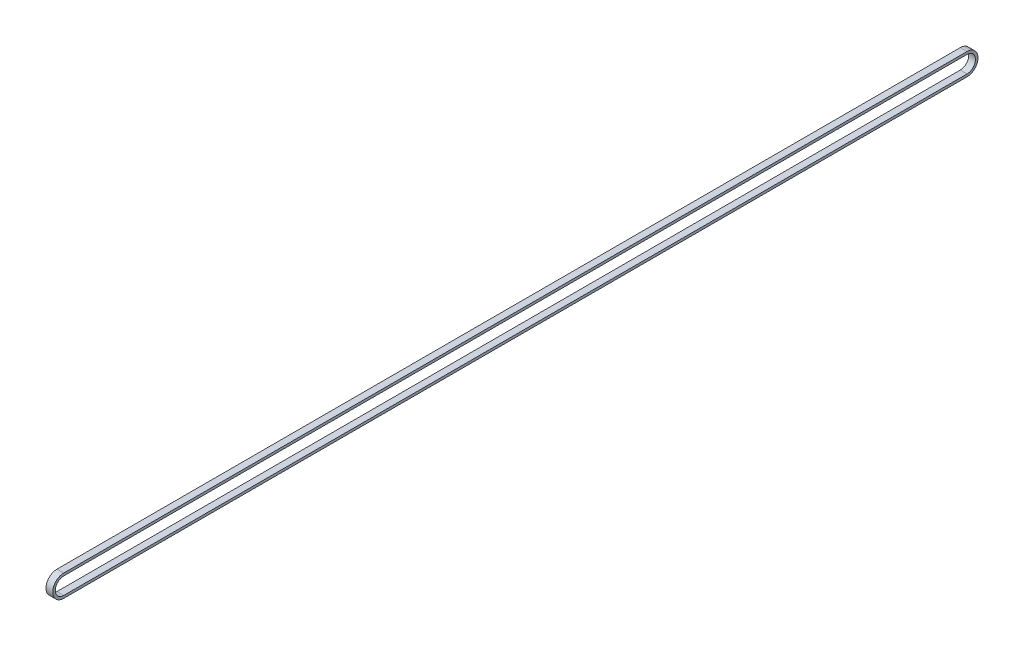
ISO-10303-21;
HEADER;
FILE_DESCRIPTION(('STEP AP214'),'2;1');
FILE_NAME('part.step','',(''),(''),'','','');
FILE_SCHEMA(('AUTOMOTIVE_DESIGN { 1 0 10303 214 1 1 1 1 }'));
ENDSEC;
DATA;
#1=APPLICATION_CONTEXT('core data for automotive mechanical design processes');
#2=APPLICATION_PROTOCOL_DEFINITION('international standard','automotive_design',2000,#1);
#3=PRODUCT_CONTEXT('',#1,'mechanical');
#4=PRODUCT('Part','Part','',(#3));
#5=PRODUCT_RELATED_PRODUCT_CATEGORY('part','',(#4));
#6=PRODUCT_DEFINITION_FORMATION('','',#4);
#7=PRODUCT_DEFINITION_CONTEXT('part definition',#1,'design');
#8=PRODUCT_DEFINITION('design','',#6,#7);
#9=PRODUCT_DEFINITION_SHAPE('','',#8);
#10=(LENGTH_UNIT() NAMED_UNIT(*) SI_UNIT(.MILLI.,.METRE.));
#11=(NAMED_UNIT(*) PLANE_ANGLE_UNIT() SI_UNIT($,.RADIAN.));
#12=(NAMED_UNIT(*) SI_UNIT($,.STERADIAN.) SOLID_ANGLE_UNIT());
#13=UNCERTAINTY_MEASURE_WITH_UNIT(LENGTH_MEASURE(1.E-05),#10,'distance_accuracy_value','');
#14=(GEOMETRIC_REPRESENTATION_CONTEXT(3) GLOBAL_UNCERTAINTY_ASSIGNED_CONTEXT((#13)) GLOBAL_UNIT_ASSIGNED_CONTEXT((#10,
#11,#12)) REPRESENTATION_CONTEXT('',''));
#15=CARTESIAN_POINT('',(0.,0.,0.));
#16=DIRECTION('',(0.,0.,1.));
#17=DIRECTION('',(1.,0.,0.));
#18=AXIS2_PLACEMENT_3D('',#15,#16,#17);
#19=CARTESIAN_POINT('',(8.,10.,0.));
#20=DIRECTION('',(-1.,0.,0.));
#21=DIRECTION('',(0.,0.,1.));
#22=AXIS2_PLACEMENT_3D('',#19,#20,#21);
#23=PLANE('',#22);
#24=CARTESIAN_POINT('',(8.,10.,0.));
#25=DIRECTION('',(1.,0.,0.));
#26=DIRECTION('',(0.,0.,1.));
#27=AXIS2_PLACEMENT_3D('',#24,#25,#26);
#28=CIRCLE('',#27,13.);
#29=CARTESIAN_POINT('',(8.,23.,0.));
#30=VERTEX_POINT('',#29);
#31=CARTESIAN_POINT('',(8.,-3.,0.));
#32=VERTEX_POINT('',#31);
#33=EDGE_CURVE('E157',#30,#32,#28,.T.);
#34=ORIENTED_EDGE('',*,*,#33,.T.);
#35=DIRECTION('',(0.,0.,-1.));
#36=VECTOR('',#35,1.);
#37=CARTESIAN_POINT('',(8.,-3.,0.));
#38=LINE('',#37,#36);
#39=CARTESIAN_POINT('',(8.,-3.,-1070.));
#40=VERTEX_POINT('',#39);
#41=EDGE_CURVE('E161',#32,#40,#38,.T.);
#42=ORIENTED_EDGE('',*,*,#41,.T.);
#43=CARTESIAN_POINT('',(8.,10.,-1070.));
#44=DIRECTION('',(1.,0.,0.));
#45=DIRECTION('',(0.,0.,1.));
#46=AXIS2_PLACEMENT_3D('',#43,#44,#45);
#47=CIRCLE('',#46,13.);
#48=CARTESIAN_POINT('',(8.,23.,-1070.));
#49=VERTEX_POINT('',#48);
#50=EDGE_CURVE('E165',#40,#49,#47,.T.);
#51=ORIENTED_EDGE('',*,*,#50,.T.);
#52=DIRECTION('',(0.,0.,1.));
#53=VECTOR('',#52,1.);
#54=CARTESIAN_POINT('',(8.,23.,0.));
#55=LINE('',#54,#53);
#56=EDGE_CURVE('E168',#49,#30,#55,.T.);
#57=ORIENTED_EDGE('',*,*,#56,.T.);
#58=EDGE_LOOP('',(#34,#42,#51,#57));
#59=FACE_BOUND('',#58,.T.);
#60=CARTESIAN_POINT('',(8.,10.,0.));
#61=DIRECTION('',(1.,0.,0.));
#62=DIRECTION('',(0.,0.,1.));
#63=AXIS2_PLACEMENT_3D('',#60,#61,#62);
#64=CIRCLE('',#63,10.);
#65=CARTESIAN_POINT('',(8.,20.,0.));
#66=VERTEX_POINT('',#65);
#67=CARTESIAN_POINT('',(8.,0.,0.));
#68=VERTEX_POINT('',#67);
#69=EDGE_CURVE('E109',#66,#68,#64,.T.);
#70=ORIENTED_EDGE('',*,*,#69,.F.);
#71=DIRECTION('',(0.,0.,1.));
#72=VECTOR('',#71,1.);
#73=CARTESIAN_POINT('',(8.,20.,0.));
#74=LINE('',#73,#72);
#75=CARTESIAN_POINT('',(8.,20.,-1070.));
#76=VERTEX_POINT('',#75);
#77=EDGE_CURVE('E135',#76,#66,#74,.T.);
#78=ORIENTED_EDGE('',*,*,#77,.F.);
#79=CARTESIAN_POINT('',(8.,10.,-1070.));
#80=DIRECTION('',(1.,0.,0.));
#81=DIRECTION('',(0.,0.,1.));
#82=AXIS2_PLACEMENT_3D('',#79,#80,#81);
#83=CIRCLE('',#82,10.);
#84=CARTESIAN_POINT('',(8.,0.,-1070.));
#85=VERTEX_POINT('',#84);
#86=EDGE_CURVE('E131',#85,#76,#83,.T.);
#87=ORIENTED_EDGE('',*,*,#86,.F.);
#88=DIRECTION('',(0.,0.,-1.));
#89=VECTOR('',#88,1.);
#90=CARTESIAN_POINT('',(8.,0.,0.));
#91=LINE('',#90,#89);
#92=EDGE_CURVE('E118',#68,#85,#91,.T.);
#93=ORIENTED_EDGE('',*,*,#92,.F.);
#94=EDGE_LOOP('',(#70,#78,#87,#93));
#95=FACE_BOUND('',#94,.T.);
#96=ADVANCED_FACE('F43',(#59,#95),#23,.F.);
#97=CARTESIAN_POINT('',(0.,10.,0.));
#98=DIRECTION('',(-1.,0.,0.));
#99=DIRECTION('',(0.,0.,1.));
#100=AXIS2_PLACEMENT_3D('',#97,#98,#99);
#101=PLANE('',#100);
#102=CARTESIAN_POINT('',(0.,10.,0.));
#103=DIRECTION('',(1.,0.,0.));
#104=DIRECTION('',(0.,0.,1.));
#105=AXIS2_PLACEMENT_3D('',#102,#103,#104);
#106=CIRCLE('',#105,13.);
#107=CARTESIAN_POINT('',(0.,23.,0.));
#108=VERTEX_POINT('',#107);
#109=CARTESIAN_POINT('',(0.,-3.,0.));
#110=VERTEX_POINT('',#109);
#111=EDGE_CURVE('E127',#108,#110,#106,.T.);
#112=ORIENTED_EDGE('',*,*,#111,.F.);
#113=DIRECTION('',(0.,0.,1.));
#114=VECTOR('',#113,1.);
#115=CARTESIAN_POINT('',(0.,23.,0.));
#116=LINE('',#115,#114);
#117=CARTESIAN_POINT('',(0.,23.,-1070.));
#118=VERTEX_POINT('',#117);
#119=EDGE_CURVE('E162',#118,#108,#116,.T.);
#120=ORIENTED_EDGE('',*,*,#119,.F.);
#121=CARTESIAN_POINT('',(0.,10.,-1070.));
#122=DIRECTION('',(1.,0.,0.));
#123=DIRECTION('',(0.,0.,1.));
#124=AXIS2_PLACEMENT_3D('',#121,#122,#123);
#125=CIRCLE('',#124,13.);
#126=CARTESIAN_POINT('',(0.,-3.,-1070.));
#127=VERTEX_POINT('',#126);
#128=EDGE_CURVE('E178',#127,#118,#125,.T.);
#129=ORIENTED_EDGE('',*,*,#128,.F.);
#130=DIRECTION('',(0.,0.,-1.));
#131=VECTOR('',#130,1.);
#132=CARTESIAN_POINT('',(0.,-3.,0.));
#133=LINE('',#132,#131);
#134=EDGE_CURVE('E175',#110,#127,#133,.T.);
#135=ORIENTED_EDGE('',*,*,#134,.F.);
#136=EDGE_LOOP('',(#112,#120,#129,#135));
#137=FACE_BOUND('',#136,.T.);
#138=DIRECTION('',(0.,0.,1.));
#139=VECTOR('',#138,1.);
#140=CARTESIAN_POINT('',(0.,20.,0.));
#141=LINE('',#140,#139);
#142=CARTESIAN_POINT('',(0.,20.,-1070.));
#143=VERTEX_POINT('',#142);
#144=CARTESIAN_POINT('',(0.,20.,0.));
#145=VERTEX_POINT('',#144);
#146=EDGE_CURVE('E119',#143,#145,#141,.T.);
#147=ORIENTED_EDGE('',*,*,#146,.T.);
#148=CARTESIAN_POINT('',(0.,10.,0.));
#149=DIRECTION('',(1.,0.,0.));
#150=DIRECTION('',(0.,0.,1.));
#151=AXIS2_PLACEMENT_3D('',#148,#149,#150);
#152=CIRCLE('',#151,10.);
#153=CARTESIAN_POINT('',(0.,0.,0.));
#154=VERTEX_POINT('',#153);
#155=EDGE_CURVE('E67',#145,#154,#152,.T.);
#156=ORIENTED_EDGE('',*,*,#155,.T.);
#157=DIRECTION('',(0.,0.,-1.));
#158=VECTOR('',#157,1.);
#159=CARTESIAN_POINT('',(0.,0.,0.));
#160=LINE('',#159,#158);
#161=CARTESIAN_POINT('',(0.,0.,-1070.));
#162=VERTEX_POINT('',#161);
#163=EDGE_CURVE('E125',#154,#162,#160,.T.);
#164=ORIENTED_EDGE('',*,*,#163,.T.);
#165=CARTESIAN_POINT('',(0.,10.,-1070.));
#166=DIRECTION('',(1.,0.,0.));
#167=DIRECTION('',(0.,0.,1.));
#168=AXIS2_PLACEMENT_3D('',#165,#166,#167);
#169=CIRCLE('',#168,10.);
#170=EDGE_CURVE('E144',#162,#143,#169,.T.);
#171=ORIENTED_EDGE('',*,*,#170,.T.);
#172=EDGE_LOOP('',(#147,#156,#164,#171));
#173=FACE_BOUND('',#172,.T.);
#174=ADVANCED_FACE('F201',(#137,#173),#101,.T.);
#175=CARTESIAN_POINT('',(8.,10.,0.));
#176=DIRECTION('',(-1.,0.,0.));
#177=DIRECTION('',(0.,0.,1.));
#178=AXIS2_PLACEMENT_3D('',#175,#176,#177);
#179=CYLINDRICAL_SURFACE('',#178,13.);
#180=ORIENTED_EDGE('',*,*,#111,.T.);
#181=DIRECTION('',(-1.,0.,0.));
#182=VECTOR('',#181,1.);
#183=CARTESIAN_POINT('',(8.,-3.,0.));
#184=LINE('',#183,#182);
#185=EDGE_CURVE('E11',#32,#110,#184,.T.);
#186=ORIENTED_EDGE('',*,*,#185,.F.);
#187=ORIENTED_EDGE('',*,*,#33,.F.);
#188=DIRECTION('',(-1.,0.,0.));
#189=VECTOR('',#188,1.);
#190=CARTESIAN_POINT('',(8.,23.,0.));
#191=LINE('',#190,#189);
#192=EDGE_CURVE('E171',#30,#108,#191,.T.);
#193=ORIENTED_EDGE('',*,*,#192,.T.);
#194=EDGE_LOOP('',(#180,#186,#187,#193));
#195=FACE_BOUND('',#194,.T.);
#196=ADVANCED_FACE('F45',(#195),#179,.T.);
#197=CARTESIAN_POINT('',(8.,-3.,0.));
#198=DIRECTION('',(0.,1.,0.));
#199=DIRECTION('',(0.,0.,1.));
#200=AXIS2_PLACEMENT_3D('',#197,#198,#199);
#201=PLANE('',#200);
#202=ORIENTED_EDGE('',*,*,#134,.T.);
#203=DIRECTION('',(-1.,0.,0.));
#204=VECTOR('',#203,1.);
#205=CARTESIAN_POINT('',(8.,-3.,-1070.));
#206=LINE('',#205,#204);
#207=EDGE_CURVE('E52',#40,#127,#206,.T.);
#208=ORIENTED_EDGE('',*,*,#207,.F.);
#209=ORIENTED_EDGE('',*,*,#41,.F.);
#210=ORIENTED_EDGE('',*,*,#185,.T.);
#211=EDGE_LOOP('',(#202,#208,#209,#210));
#212=FACE_BOUND('',#211,.T.);
#213=ADVANCED_FACE('F211',(#212),#201,.F.);
#214=CARTESIAN_POINT('',(8.,10.,-1070.));
#215=DIRECTION('',(-1.,0.,0.));
#216=DIRECTION('',(0.,0.,1.));
#217=AXIS2_PLACEMENT_3D('',#214,#215,#216);
#218=CYLINDRICAL_SURFACE('',#217,13.);
#219=ORIENTED_EDGE('',*,*,#128,.T.);
#220=DIRECTION('',(-1.,0.,0.));
#221=VECTOR('',#220,1.);
#222=CARTESIAN_POINT('',(8.,23.,-1070.));
#223=LINE('',#222,#221);
#224=EDGE_CURVE('E186',#49,#118,#223,.T.);
#225=ORIENTED_EDGE('',*,*,#224,.F.);
#226=ORIENTED_EDGE('',*,*,#50,.F.);
#227=ORIENTED_EDGE('',*,*,#207,.T.);
#228=EDGE_LOOP('',(#219,#225,#226,#227));
#229=FACE_BOUND('',#228,.T.);
#230=ADVANCED_FACE('F195',(#229),#218,.T.);
#231=CARTESIAN_POINT('',(8.,23.,0.));
#232=DIRECTION('',(0.,-1.,0.));
#233=DIRECTION('',(0.,0.,-1.));
#234=AXIS2_PLACEMENT_3D('',#231,#232,#233);
#235=PLANE('',#234);
#236=ORIENTED_EDGE('',*,*,#119,.T.);
#237=ORIENTED_EDGE('',*,*,#192,.F.);
#238=ORIENTED_EDGE('',*,*,#56,.F.);
#239=ORIENTED_EDGE('',*,*,#224,.T.);
#240=EDGE_LOOP('',(#236,#237,#238,#239));
#241=FACE_BOUND('',#240,.T.);
#242=ADVANCED_FACE('F205',(#241),#235,.F.);
#243=CARTESIAN_POINT('',(8.,10.,0.));
#244=DIRECTION('',(-1.,0.,0.));
#245=DIRECTION('',(0.,0.,1.));
#246=AXIS2_PLACEMENT_3D('',#243,#244,#245);
#247=CYLINDRICAL_SURFACE('',#246,10.);
#248=ORIENTED_EDGE('',*,*,#155,.F.);
#249=DIRECTION('',(-1.,0.,0.));
#250=VECTOR('',#249,1.);
#251=CARTESIAN_POINT('',(8.,20.,0.));
#252=LINE('',#251,#250);
#253=EDGE_CURVE('E113',#66,#145,#252,.T.);
#254=ORIENTED_EDGE('',*,*,#253,.F.);
#255=ORIENTED_EDGE('',*,*,#69,.T.);
#256=DIRECTION('',(-1.,0.,0.));
#257=VECTOR('',#256,1.);
#258=CARTESIAN_POINT('',(8.,0.,0.));
#259=LINE('',#258,#257);
#260=EDGE_CURVE('E112',#68,#154,#259,.T.);
#261=ORIENTED_EDGE('',*,*,#260,.T.);
#262=EDGE_LOOP('',(#248,#254,#255,#261));
#263=FACE_BOUND('',#262,.T.);
#264=ADVANCED_FACE('F111',(#263),#247,.F.);
#265=CARTESIAN_POINT('',(8.,0.,0.));
#266=DIRECTION('',(0.,1.,0.));
#267=DIRECTION('',(0.,0.,1.));
#268=AXIS2_PLACEMENT_3D('',#265,#266,#267);
#269=PLANE('',#268);
#270=ORIENTED_EDGE('',*,*,#163,.F.);
#271=ORIENTED_EDGE('',*,*,#260,.F.);
#272=ORIENTED_EDGE('',*,*,#92,.T.);
#273=DIRECTION('',(-1.,0.,0.));
#274=VECTOR('',#273,1.);
#275=CARTESIAN_POINT('',(8.,0.,-1070.));
#276=LINE('',#275,#274);
#277=EDGE_CURVE('E128',#85,#162,#276,.T.);
#278=ORIENTED_EDGE('',*,*,#277,.T.);
#279=EDGE_LOOP('',(#270,#271,#272,#278));
#280=FACE_BOUND('',#279,.T.);
#281=ADVANCED_FACE('F122',(#280),#269,.T.);
#282=CARTESIAN_POINT('',(8.,10.,-1070.));
#283=DIRECTION('',(-1.,0.,0.));
#284=DIRECTION('',(0.,0.,1.));
#285=AXIS2_PLACEMENT_3D('',#282,#283,#284);
#286=CYLINDRICAL_SURFACE('',#285,10.);
#287=ORIENTED_EDGE('',*,*,#170,.F.);
#288=ORIENTED_EDGE('',*,*,#277,.F.);
#289=ORIENTED_EDGE('',*,*,#86,.T.);
#290=DIRECTION('',(-1.,0.,0.));
#291=VECTOR('',#290,1.);
#292=CARTESIAN_POINT('',(8.,20.,-1070.));
#293=LINE('',#292,#291);
#294=EDGE_CURVE('E59',#76,#143,#293,.T.);
#295=ORIENTED_EDGE('',*,*,#294,.T.);
#296=EDGE_LOOP('',(#287,#288,#289,#295));
#297=FACE_BOUND('',#296,.T.);
#298=ADVANCED_FACE('F234',(#297),#286,.F.);
#299=CARTESIAN_POINT('',(8.,20.,0.));
#300=DIRECTION('',(0.,-1.,0.));
#301=DIRECTION('',(0.,0.,-1.));
#302=AXIS2_PLACEMENT_3D('',#299,#300,#301);
#303=PLANE('',#302);
#304=ORIENTED_EDGE('',*,*,#146,.F.);
#305=ORIENTED_EDGE('',*,*,#294,.F.);
#306=ORIENTED_EDGE('',*,*,#77,.T.);
#307=ORIENTED_EDGE('',*,*,#253,.T.);
#308=EDGE_LOOP('',(#304,#305,#306,#307));
#309=FACE_BOUND('',#308,.T.);
#310=ADVANCED_FACE('F238',(#309),#303,.T.);
#311=CLOSED_SHELL('',(#96,#174,#196,#213,#230,#242,#264,#281,#298,#310));
#312=MANIFOLD_SOLID_BREP('B2',#311);
#313=ADVANCED_BREP_SHAPE_REPRESENTATION('',(#18,#312),#14);
#314=SHAPE_DEFINITION_REPRESENTATION(#9,#313);
ENDSEC;
END-ISO-10303-21;
